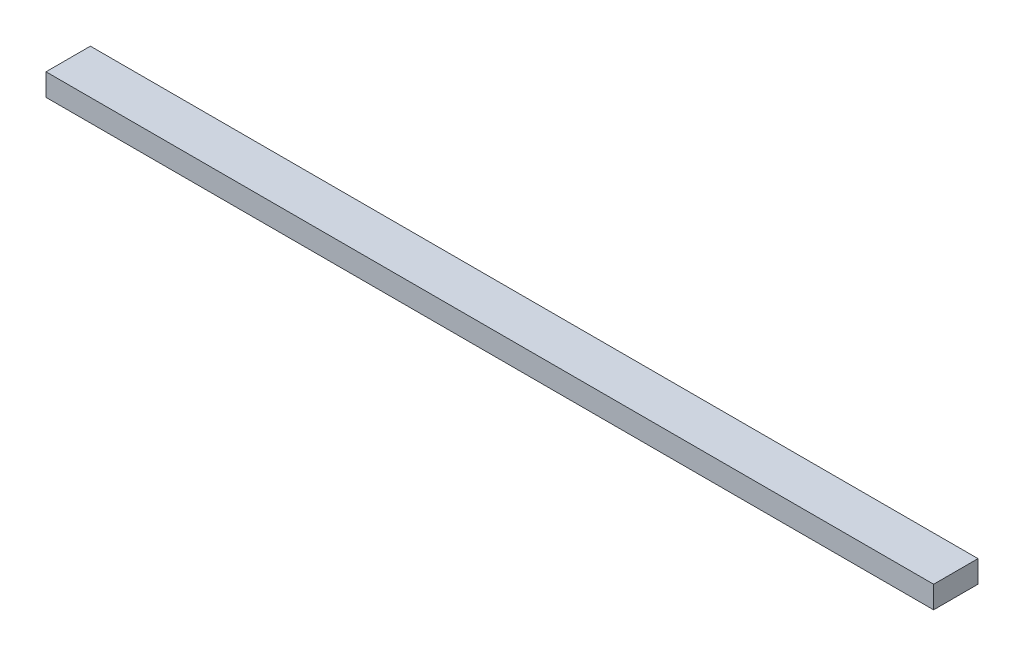
ISO-10303-21;
HEADER;
FILE_DESCRIPTION(('STEP AP214'),'2;1');
FILE_NAME('part.step','',(''),(''),'','','');
FILE_SCHEMA(('AUTOMOTIVE_DESIGN { 1 0 10303 214 1 1 1 1 }'));
ENDSEC;
DATA;
#1=APPLICATION_CONTEXT('core data for automotive mechanical design processes');
#2=APPLICATION_PROTOCOL_DEFINITION('international standard','automotive_design',2000,#1);
#3=PRODUCT_CONTEXT('',#1,'mechanical');
#4=PRODUCT('Part','Part','',(#3));
#5=PRODUCT_RELATED_PRODUCT_CATEGORY('part','',(#4));
#6=PRODUCT_DEFINITION_FORMATION('','',#4);
#7=PRODUCT_DEFINITION_CONTEXT('part definition',#1,'design');
#8=PRODUCT_DEFINITION('design','',#6,#7);
#9=PRODUCT_DEFINITION_SHAPE('','',#8);
#10=(LENGTH_UNIT() NAMED_UNIT(*) SI_UNIT(.MILLI.,.METRE.));
#11=(NAMED_UNIT(*) PLANE_ANGLE_UNIT() SI_UNIT($,.RADIAN.));
#12=(NAMED_UNIT(*) SI_UNIT($,.STERADIAN.) SOLID_ANGLE_UNIT());
#13=UNCERTAINTY_MEASURE_WITH_UNIT(LENGTH_MEASURE(1.E-05),#10,'distance_accuracy_value','');
#14=(GEOMETRIC_REPRESENTATION_CONTEXT(3) GLOBAL_UNCERTAINTY_ASSIGNED_CONTEXT((#13)) GLOBAL_UNIT_ASSIGNED_CONTEXT((#10,
#11,#12)) REPRESENTATION_CONTEXT('',''));
#15=CARTESIAN_POINT('',(0.,0.,0.));
#16=DIRECTION('',(0.,0.,1.));
#17=DIRECTION('',(1.,0.,0.));
#18=AXIS2_PLACEMENT_3D('',#15,#16,#17);
#19=CARTESIAN_POINT('',(-200.,10.,-9.99999999999999));
#20=DIRECTION('',(1.,0.,0.));
#21=DIRECTION('',(0.,0.,-1.));
#22=AXIS2_PLACEMENT_3D('',#19,#20,#21);
#23=PLANE('',#22);
#24=DIRECTION('',(0.,0.,1.));
#25=VECTOR('',#24,1.);
#26=CARTESIAN_POINT('',(-200.,0.,-9.99999999999999));
#27=LINE('',#26,#25);
#28=CARTESIAN_POINT('',(-200.,0.,-9.99999999999999));
#29=VERTEX_POINT('',#28);
#30=CARTESIAN_POINT('',(-200.,0.,9.99999999999999));
#31=VERTEX_POINT('',#30);
#32=EDGE_CURVE('E97',#29,#31,#27,.T.);
#33=ORIENTED_EDGE('',*,*,#32,.T.);
#34=DIRECTION('',(0.,-1.,0.));
#35=VECTOR('',#34,1.);
#36=CARTESIAN_POINT('',(-200.,10.,9.99999999999999));
#37=LINE('',#36,#35);
#38=CARTESIAN_POINT('',(-200.,10.,9.99999999999999));
#39=VERTEX_POINT('',#38);
#40=EDGE_CURVE('E11',#39,#31,#37,.T.);
#41=ORIENTED_EDGE('',*,*,#40,.F.);
#42=DIRECTION('',(0.,0.,1.));
#43=VECTOR('',#42,1.);
#44=CARTESIAN_POINT('',(-200.,10.,-9.99999999999999));
#45=LINE('',#44,#43);
#46=CARTESIAN_POINT('',(-200.,10.,-9.99999999999999));
#47=VERTEX_POINT('',#46);
#48=EDGE_CURVE('E85',#47,#39,#45,.T.);
#49=ORIENTED_EDGE('',*,*,#48,.F.);
#50=DIRECTION('',(0.,-1.,0.));
#51=VECTOR('',#50,1.);
#52=CARTESIAN_POINT('',(-200.,10.,-9.99999999999999));
#53=LINE('',#52,#51);
#54=EDGE_CURVE('E93',#47,#29,#53,.T.);
#55=ORIENTED_EDGE('',*,*,#54,.T.);
#56=EDGE_LOOP('',(#33,#41,#49,#55));
#57=FACE_BOUND('',#56,.T.);
#58=ADVANCED_FACE('F34',(#57),#23,.F.);
#59=CARTESIAN_POINT('',(-200.,10.,9.99999999999999));
#60=DIRECTION('',(0.,0.,-1.));
#61=DIRECTION('',(-1.,0.,0.));
#62=AXIS2_PLACEMENT_3D('',#59,#60,#61);
#63=PLANE('',#62);
#64=DIRECTION('',(1.,0.,0.));
#65=VECTOR('',#64,1.);
#66=CARTESIAN_POINT('',(-200.,0.,9.99999999999999));
#67=LINE('',#66,#65);
#68=CARTESIAN_POINT('',(200.,0.,9.99999999999999));
#69=VERTEX_POINT('',#68);
#70=EDGE_CURVE('E89',#31,#69,#67,.T.);
#71=ORIENTED_EDGE('',*,*,#70,.T.);
#72=DIRECTION('',(0.,-1.,0.));
#73=VECTOR('',#72,1.);
#74=CARTESIAN_POINT('',(200.,10.,9.99999999999999));
#75=LINE('',#74,#73);
#76=CARTESIAN_POINT('',(200.,10.,9.99999999999999));
#77=VERTEX_POINT('',#76);
#78=EDGE_CURVE('E42',#77,#69,#75,.T.);
#79=ORIENTED_EDGE('',*,*,#78,.F.);
#80=DIRECTION('',(1.,0.,0.));
#81=VECTOR('',#80,1.);
#82=CARTESIAN_POINT('',(-200.,10.,9.99999999999999));
#83=LINE('',#82,#81);
#84=EDGE_CURVE('E80',#39,#77,#83,.T.);
#85=ORIENTED_EDGE('',*,*,#84,.F.);
#86=ORIENTED_EDGE('',*,*,#40,.T.);
#87=EDGE_LOOP('',(#71,#79,#85,#86));
#88=FACE_BOUND('',#87,.T.);
#89=ADVANCED_FACE('F88',(#88),#63,.F.);
#90=CARTESIAN_POINT('',(200.,10.,-9.99999999999999));
#91=DIRECTION('',(-1.,0.,0.));
#92=DIRECTION('',(0.,0.,1.));
#93=AXIS2_PLACEMENT_3D('',#90,#91,#92);
#94=PLANE('',#93);
#95=DIRECTION('',(0.,0.,-1.));
#96=VECTOR('',#95,1.);
#97=CARTESIAN_POINT('',(200.,0.,-9.99999999999999));
#98=LINE('',#97,#96);
#99=CARTESIAN_POINT('',(200.,0.,-9.99999999999999));
#100=VERTEX_POINT('',#99);
#101=EDGE_CURVE('E67',#69,#100,#98,.T.);
#102=ORIENTED_EDGE('',*,*,#101,.T.);
#103=DIRECTION('',(0.,-1.,0.));
#104=VECTOR('',#103,1.);
#105=CARTESIAN_POINT('',(200.,10.,-9.99999999999999));
#106=LINE('',#105,#104);
#107=CARTESIAN_POINT('',(200.,10.,-9.99999999999999));
#108=VERTEX_POINT('',#107);
#109=EDGE_CURVE('E90',#108,#100,#106,.T.);
#110=ORIENTED_EDGE('',*,*,#109,.F.);
#111=DIRECTION('',(0.,0.,-1.));
#112=VECTOR('',#111,1.);
#113=CARTESIAN_POINT('',(200.,10.,-9.99999999999999));
#114=LINE('',#113,#112);
#115=EDGE_CURVE('E83',#77,#108,#114,.T.);
#116=ORIENTED_EDGE('',*,*,#115,.F.);
#117=ORIENTED_EDGE('',*,*,#78,.T.);
#118=EDGE_LOOP('',(#102,#110,#116,#117));
#119=FACE_BOUND('',#118,.T.);
#120=ADVANCED_FACE('F91',(#119),#94,.F.);
#121=CARTESIAN_POINT('',(-200.,10.,-9.99999999999999));
#122=DIRECTION('',(0.,0.,1.));
#123=DIRECTION('',(1.,0.,0.));
#124=AXIS2_PLACEMENT_3D('',#121,#122,#123);
#125=PLANE('',#124);
#126=DIRECTION('',(-1.,0.,0.));
#127=VECTOR('',#126,1.);
#128=CARTESIAN_POINT('',(-200.,0.,-9.99999999999999));
#129=LINE('',#128,#127);
#130=EDGE_CURVE('E73',#100,#29,#129,.T.);
#131=ORIENTED_EDGE('',*,*,#130,.T.);
#132=ORIENTED_EDGE('',*,*,#54,.F.);
#133=DIRECTION('',(-1.,0.,0.));
#134=VECTOR('',#133,1.);
#135=CARTESIAN_POINT('',(-200.,10.,-9.99999999999999));
#136=LINE('',#135,#134);
#137=EDGE_CURVE('E50',#108,#47,#136,.T.);
#138=ORIENTED_EDGE('',*,*,#137,.F.);
#139=ORIENTED_EDGE('',*,*,#109,.T.);
#140=EDGE_LOOP('',(#131,#132,#138,#139));
#141=FACE_BOUND('',#140,.T.);
#142=ADVANCED_FACE('F104',(#141),#125,.F.);
#143=CARTESIAN_POINT('',(0.,10.,0.));
#144=DIRECTION('',(0.,1.,0.));
#145=DIRECTION('',(0.,0.,1.));
#146=AXIS2_PLACEMENT_3D('',#143,#144,#145);
#147=PLANE('',#146);
#148=ORIENTED_EDGE('',*,*,#48,.T.);
#149=ORIENTED_EDGE('',*,*,#84,.T.);
#150=ORIENTED_EDGE('',*,*,#115,.T.);
#151=ORIENTED_EDGE('',*,*,#137,.T.);
#152=EDGE_LOOP('',(#148,#149,#150,#151));
#153=FACE_BOUND('',#152,.T.);
#154=ADVANCED_FACE('F81',(#153),#147,.T.);
#155=CARTESIAN_POINT('',(0.,0.,0.));
#156=DIRECTION('',(0.,1.,0.));
#157=DIRECTION('',(0.,0.,1.));
#158=AXIS2_PLACEMENT_3D('',#155,#156,#157);
#159=PLANE('',#158);
#160=ORIENTED_EDGE('',*,*,#32,.F.);
#161=ORIENTED_EDGE('',*,*,#130,.F.);
#162=ORIENTED_EDGE('',*,*,#101,.F.);
#163=ORIENTED_EDGE('',*,*,#70,.F.);
#164=EDGE_LOOP('',(#160,#161,#162,#163));
#165=FACE_BOUND('',#164,.T.);
#166=ADVANCED_FACE('F107',(#165),#159,.F.);
#167=CLOSED_SHELL('',(#58,#89,#120,#142,#154,#166));
#168=MANIFOLD_SOLID_BREP('B2',#167);
#169=ADVANCED_BREP_SHAPE_REPRESENTATION('',(#18,#168),#14);
#170=SHAPE_DEFINITION_REPRESENTATION(#9,#169);
ENDSEC;
END-ISO-10303-21;
